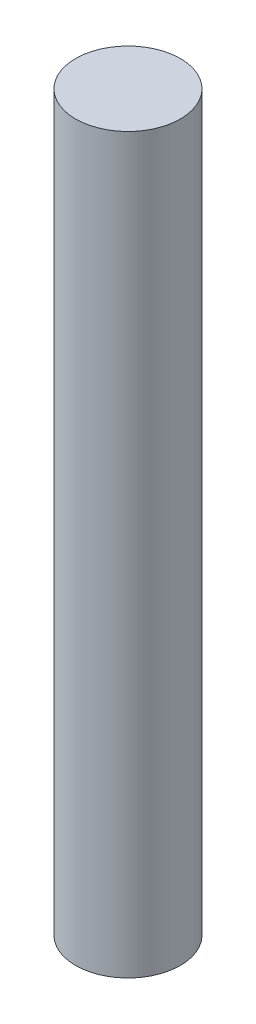
ISO-10303-21;
HEADER;
FILE_DESCRIPTION(('STEP AP214'),'2;1');
FILE_NAME('part.step','',(''),(''),'','','');
FILE_SCHEMA(('AUTOMOTIVE_DESIGN { 1 0 10303 214 1 1 1 1 }'));
ENDSEC;
DATA;
#1=APPLICATION_CONTEXT('core data for automotive mechanical design processes');
#2=APPLICATION_PROTOCOL_DEFINITION('international standard','automotive_design',2000,#1);
#3=PRODUCT_CONTEXT('',#1,'mechanical');
#4=PRODUCT('Part','Part','',(#3));
#5=PRODUCT_RELATED_PRODUCT_CATEGORY('part','',(#4));
#6=PRODUCT_DEFINITION_FORMATION('','',#4);
#7=PRODUCT_DEFINITION_CONTEXT('part definition',#1,'design');
#8=PRODUCT_DEFINITION('design','',#6,#7);
#9=PRODUCT_DEFINITION_SHAPE('','',#8);
#10=(LENGTH_UNIT() NAMED_UNIT(*) SI_UNIT(.MILLI.,.METRE.));
#11=(NAMED_UNIT(*) PLANE_ANGLE_UNIT() SI_UNIT($,.RADIAN.));
#12=(NAMED_UNIT(*) SI_UNIT($,.STERADIAN.) SOLID_ANGLE_UNIT());
#13=UNCERTAINTY_MEASURE_WITH_UNIT(LENGTH_MEASURE(1.E-05),#10,'distance_accuracy_value','');
#14=(GEOMETRIC_REPRESENTATION_CONTEXT(3) GLOBAL_UNCERTAINTY_ASSIGNED_CONTEXT((#13)) GLOBAL_UNIT_ASSIGNED_CONTEXT((#10,
#11,#12)) REPRESENTATION_CONTEXT('',''));
#15=CARTESIAN_POINT('',(0.,0.,0.));
#16=DIRECTION('',(0.,0.,1.));
#17=DIRECTION('',(1.,0.,0.));
#18=AXIS2_PLACEMENT_3D('',#15,#16,#17);
#19=CARTESIAN_POINT('',(0.,35.,0.));
#20=DIRECTION('',(0.,-1.,0.));
#21=DIRECTION('',(0.,0.,-1.));
#22=AXIS2_PLACEMENT_3D('',#19,#20,#21);
#23=CYLINDRICAL_SURFACE('',#22,2.5);
#24=CARTESIAN_POINT('',(0.,35.,0.));
#25=DIRECTION('',(0.,1.,0.));
#26=DIRECTION('',(0.,0.,1.));
#27=AXIS2_PLACEMENT_3D('',#24,#25,#26);
#28=CIRCLE('',#27,2.5);
#29=CARTESIAN_POINT('',(0.,35.,2.5));
#30=VERTEX_POINT('',#29);
#31=EDGE_CURVE('E10',#30,#30,#28,.T.);
#32=ORIENTED_EDGE('',*,*,#31,.F.);
#33=EDGE_LOOP('',(#32));
#34=FACE_BOUND('',#33,.T.);
#35=CARTESIAN_POINT('',(0.,0.,0.));
#36=DIRECTION('',(0.,1.,0.));
#37=DIRECTION('',(0.,0.,1.));
#38=AXIS2_PLACEMENT_3D('',#35,#36,#37);
#39=CIRCLE('',#38,2.5);
#40=CARTESIAN_POINT('',(0.,0.,2.5));
#41=VERTEX_POINT('',#40);
#42=EDGE_CURVE('E33',#41,#41,#39,.T.);
#43=ORIENTED_EDGE('',*,*,#42,.T.);
#44=EDGE_LOOP('',(#43));
#45=FACE_BOUND('',#44,.T.);
#46=ADVANCED_FACE('F30',(#34,#45),#23,.T.);
#47=CARTESIAN_POINT('',(0.,35.,0.));
#48=DIRECTION('',(0.,1.,0.));
#49=DIRECTION('',(0.,0.,1.));
#50=AXIS2_PLACEMENT_3D('',#47,#48,#49);
#51=PLANE('',#50);
#52=ORIENTED_EDGE('',*,*,#31,.T.);
#53=EDGE_LOOP('',(#52));
#54=FACE_BOUND('',#53,.T.);
#55=ADVANCED_FACE('F45',(#54),#51,.T.);
#56=CARTESIAN_POINT('',(0.,0.,0.));
#57=DIRECTION('',(0.,1.,0.));
#58=DIRECTION('',(0.,0.,1.));
#59=AXIS2_PLACEMENT_3D('',#56,#57,#58);
#60=PLANE('',#59);
#61=ORIENTED_EDGE('',*,*,#42,.F.);
#62=EDGE_LOOP('',(#61));
#63=FACE_BOUND('',#62,.T.);
#64=ADVANCED_FACE('F43',(#63),#60,.F.);
#65=CLOSED_SHELL('',(#46,#55,#64));
#66=MANIFOLD_SOLID_BREP('B2',#65);
#67=ADVANCED_BREP_SHAPE_REPRESENTATION('',(#18,#66),#14);
#68=SHAPE_DEFINITION_REPRESENTATION(#9,#67);
ENDSEC;
END-ISO-10303-21;
